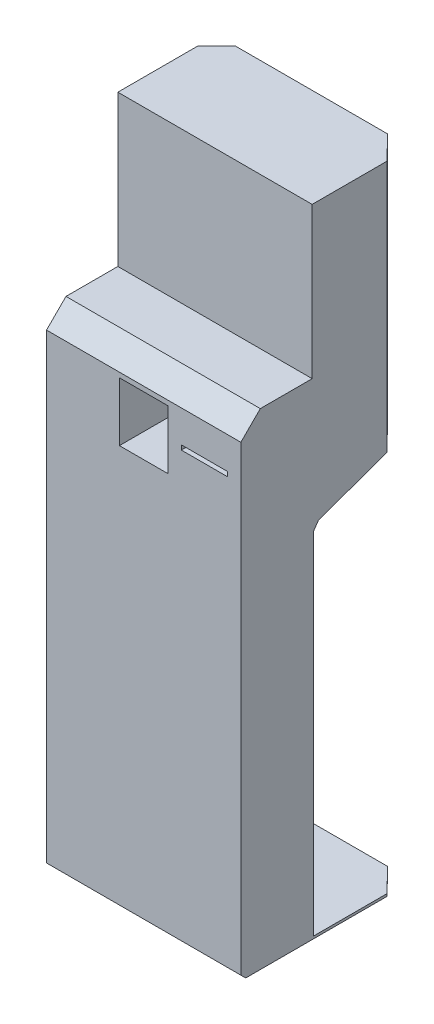
ISO-10303-21;
HEADER;
FILE_DESCRIPTION(('STEP AP214'),'2;1');
FILE_NAME('part.step','',(''),(''),'','','');
FILE_SCHEMA(('AUTOMOTIVE_DESIGN { 1 0 10303 214 1 1 1 1 }'));
ENDSEC;
DATA;
#1=APPLICATION_CONTEXT('core data for automotive mechanical design processes');
#2=APPLICATION_PROTOCOL_DEFINITION('international standard','automotive_design',2000,#1);
#3=PRODUCT_CONTEXT('',#1,'mechanical');
#4=PRODUCT('Part','Part','',(#3));
#5=PRODUCT_RELATED_PRODUCT_CATEGORY('part','',(#4));
#6=PRODUCT_DEFINITION_FORMATION('','',#4);
#7=PRODUCT_DEFINITION_CONTEXT('part definition',#1,'design');
#8=PRODUCT_DEFINITION('design','',#6,#7);
#9=PRODUCT_DEFINITION_SHAPE('','',#8);
#10=(LENGTH_UNIT() NAMED_UNIT(*) SI_UNIT(.MILLI.,.METRE.));
#11=(NAMED_UNIT(*) PLANE_ANGLE_UNIT() SI_UNIT($,.RADIAN.));
#12=(NAMED_UNIT(*) SI_UNIT($,.STERADIAN.) SOLID_ANGLE_UNIT());
#13=UNCERTAINTY_MEASURE_WITH_UNIT(LENGTH_MEASURE(1.E-05),#10,'distance_accuracy_value','');
#14=(GEOMETRIC_REPRESENTATION_CONTEXT(3) GLOBAL_UNCERTAINTY_ASSIGNED_CONTEXT((#13)) GLOBAL_UNIT_ASSIGNED_CONTEXT((#10,
#11,#12)) REPRESENTATION_CONTEXT('',''));
#15=CARTESIAN_POINT('',(0.,0.,0.));
#16=DIRECTION('',(0.,0.,1.));
#17=DIRECTION('',(1.,0.,0.));
#18=AXIS2_PLACEMENT_3D('',#15,#16,#17);
#19=CARTESIAN_POINT('',(400.,5.,0.));
#20=DIRECTION('',(0.,0.,1.));
#21=DIRECTION('',(0.,-1.,0.));
#22=AXIS2_PLACEMENT_3D('',#19,#20,#21);
#23=PLANE('',#22);
#24=DIRECTION('',(-1.,0.,0.));
#25=VECTOR('',#24,1.);
#26=CARTESIAN_POINT('',(400.,0.,0.));
#27=LINE('',#26,#25);
#28=CARTESIAN_POINT('',(351.734705208214,0.,0.));
#29=VERTEX_POINT('',#28);
#30=CARTESIAN_POINT('',(38.6420778551322,0.,0.));
#31=VERTEX_POINT('',#30);
#32=EDGE_CURVE('E283',#29,#31,#27,.T.);
#33=ORIENTED_EDGE('',*,*,#32,.T.);
#34=DIRECTION('',(0.,1.,0.));
#35=VECTOR('',#34,1.);
#36=CARTESIAN_POINT('',(38.6420778551322,5.00000000000004,0.));
#37=LINE('',#36,#35);
#38=CARTESIAN_POINT('',(38.6420778551322,5.,0.));
#39=VERTEX_POINT('',#38);
#40=EDGE_CURVE('E369',#31,#39,#37,.T.);
#41=ORIENTED_EDGE('',*,*,#40,.T.);
#42=DIRECTION('',(-1.,0.,0.));
#43=VECTOR('',#42,1.);
#44=CARTESIAN_POINT('',(400.,5.,0.));
#45=LINE('',#44,#43);
#46=CARTESIAN_POINT('',(351.734705208214,5.,0.));
#47=VERTEX_POINT('',#46);
#48=EDGE_CURVE('E250',#47,#39,#45,.T.);
#49=ORIENTED_EDGE('',*,*,#48,.F.);
#50=DIRECTION('',(0.,-1.,0.));
#51=VECTOR('',#50,1.);
#52=CARTESIAN_POINT('',(351.734705208214,4.99999999999999,0.));
#53=LINE('',#52,#51);
#54=EDGE_CURVE('E370',#47,#29,#53,.T.);
#55=ORIENTED_EDGE('',*,*,#54,.T.);
#56=EDGE_LOOP('',(#33,#41,#49,#55));
#57=FACE_BOUND('',#56,.T.);
#58=ADVANCED_FACE('F35',(#57),#23,.F.);
#59=CARTESIAN_POINT('',(400.,5.,200.));
#60=DIRECTION('',(0.,-1.,0.));
#61=DIRECTION('',(0.,0.,-1.));
#62=AXIS2_PLACEMENT_3D('',#59,#60,#61);
#63=PLANE('',#62);
#64=ORIENTED_EDGE('',*,*,#48,.T.);
#65=DIRECTION('',(-0.701254440401762,0.,0.712911081283502));
#66=VECTOR('',#65,1.);
#67=CARTESIAN_POINT('',(116.356238841946,5.,-79.0059689438939));
#68=LINE('',#67,#66);
#69=CARTESIAN_POINT('',(0.,5.,39.284407940377));
#70=VERTEX_POINT('',#69);
#71=EDGE_CURVE('E378',#39,#70,#68,.T.);
#72=ORIENTED_EDGE('',*,*,#71,.T.);
#73=DIRECTION('',(0.,0.,1.));
#74=VECTOR('',#73,1.);
#75=CARTESIAN_POINT('',(0.,5.,200.));
#76=LINE('',#75,#74);
#77=CARTESIAN_POINT('',(0.,5.,200.));
#78=VERTEX_POINT('',#77);
#79=EDGE_CURVE('E284',#70,#78,#76,.T.);
#80=ORIENTED_EDGE('',*,*,#79,.T.);
#81=DIRECTION('',(-1.,0.,0.));
#82=VECTOR('',#81,1.);
#83=CARTESIAN_POINT('',(400.,5.,200.));
#84=LINE('',#83,#82);
#85=CARTESIAN_POINT('',(400.,5.,200.));
#86=VERTEX_POINT('',#85);
#87=EDGE_CURVE('E247',#86,#78,#84,.T.);
#88=ORIENTED_EDGE('',*,*,#87,.F.);
#89=DIRECTION('',(0.,0.,1.));
#90=VECTOR('',#89,1.);
#91=CARTESIAN_POINT('',(400.,5.,200.));
#92=LINE('',#91,#90);
#93=CARTESIAN_POINT('',(400.,5.,49.0675873350135));
#94=VERTEX_POINT('',#93);
#95=EDGE_CURVE('E310',#94,#86,#92,.T.);
#96=ORIENTED_EDGE('',*,*,#95,.F.);
#97=DIRECTION('',(-0.701254440401762,0.,-0.712911081283502));
#98=VECTOR('',#97,1.);
#99=CARTESIAN_POINT('',(475.455952189898,5.,125.777810280849));
#100=LINE('',#99,#98);
#101=EDGE_CURVE('E57',#94,#47,#100,.T.);
#102=ORIENTED_EDGE('',*,*,#101,.T.);
#103=EDGE_LOOP('',(#64,#72,#80,#88,#96,#102));
#104=FACE_BOUND('',#103,.T.);
#105=ADVANCED_FACE('F358',(#104),#63,.F.);
#106=CARTESIAN_POINT('',(400.,727.20595314676,200.));
#107=DIRECTION('',(0.,0.,1.));
#108=DIRECTION('',(0.,-1.,0.));
#109=AXIS2_PLACEMENT_3D('',#106,#107,#108);
#110=PLANE('',#109);
#111=DIRECTION('',(0.,1.,0.));
#112=VECTOR('',#111,1.);
#113=CARTESIAN_POINT('',(0.,727.20595314676,200.));
#114=LINE('',#113,#112);
#115=CARTESIAN_POINT('',(0.,727.20595314676,200.));
#116=VERTEX_POINT('',#115);
#117=EDGE_CURVE('E286',#78,#116,#114,.T.);
#118=ORIENTED_EDGE('',*,*,#117,.T.);
#119=DIRECTION('',(-1.,0.,0.));
#120=VECTOR('',#119,1.);
#121=CARTESIAN_POINT('',(400.,727.20595314676,200.));
#122=LINE('',#121,#120);
#123=CARTESIAN_POINT('',(400.,727.20595314676,200.));
#124=VERTEX_POINT('',#123);
#125=EDGE_CURVE('E244',#124,#116,#122,.T.);
#126=ORIENTED_EDGE('',*,*,#125,.F.);
#127=DIRECTION('',(0.,1.,0.));
#128=VECTOR('',#127,1.);
#129=CARTESIAN_POINT('',(400.,727.20595314676,200.));
#130=LINE('',#129,#128);
#131=EDGE_CURVE('E458',#86,#124,#130,.T.);
#132=ORIENTED_EDGE('',*,*,#131,.F.);
#133=ORIENTED_EDGE('',*,*,#87,.T.);
#134=EDGE_LOOP('',(#118,#126,#132,#133));
#135=FACE_BOUND('',#134,.T.);
#136=ADVANCED_FACE('F363',(#135),#110,.F.);
#137=CARTESIAN_POINT('',(400.,740.626154580017,190.603073792141));
#138=DIRECTION('',(0.,0.573576436351043,0.819152044288994));
#139=DIRECTION('',(0.,-0.819152044288994,0.573576436351043));
#140=AXIS2_PLACEMENT_3D('',#137,#138,#139);
#141=PLANE('',#140);
#142=DIRECTION('',(0.,0.819152044288994,-0.573576436351043));
#143=VECTOR('',#142,1.);
#144=CARTESIAN_POINT('',(0.,740.626154580017,190.603073792141));
#145=LINE('',#144,#143);
#146=CARTESIAN_POINT('',(0.,740.626154580017,190.603073792141));
#147=VERTEX_POINT('',#146);
#148=EDGE_CURVE('E289',#116,#147,#145,.T.);
#149=ORIENTED_EDGE('',*,*,#148,.T.);
#150=DIRECTION('',(-1.,0.,0.));
#151=VECTOR('',#150,1.);
#152=CARTESIAN_POINT('',(400.,740.626154580017,190.603073792141));
#153=LINE('',#152,#151);
#154=CARTESIAN_POINT('',(400.,740.626154580017,190.603073792141));
#155=VERTEX_POINT('',#154);
#156=EDGE_CURVE('E241',#155,#147,#153,.T.);
#157=ORIENTED_EDGE('',*,*,#156,.F.);
#158=DIRECTION('',(0.,0.819152044288994,-0.573576436351043));
#159=VECTOR('',#158,1.);
#160=CARTESIAN_POINT('',(400.,740.626154580017,190.603073792141));
#161=LINE('',#160,#159);
#162=EDGE_CURVE('E270',#124,#155,#161,.T.);
#163=ORIENTED_EDGE('',*,*,#162,.F.);
#164=ORIENTED_EDGE('',*,*,#125,.T.);
#165=EDGE_LOOP('',(#149,#157,#163,#164));
#166=FACE_BOUND('',#165,.T.);
#167=ADVANCED_FACE('F464',(#166),#141,.F.);
#168=CARTESIAN_POINT('',(400.,806.579798566743,9.39692620785923));
#169=DIRECTION('',(0.,0.939692620785909,0.342020143325666));
#170=DIRECTION('',(0.,-0.342020143325666,0.93969262078591));
#171=AXIS2_PLACEMENT_3D('',#168,#169,#170);
#172=PLANE('',#171);
#173=DIRECTION('',(0.,0.342020143325666,-0.939692620785909));
#174=VECTOR('',#173,1.);
#175=CARTESIAN_POINT('',(0.,806.579798566743,9.39692620785923));
#176=LINE('',#175,#174);
#177=CARTESIAN_POINT('',(0.,795.701644838932,39.284407940377));
#178=VERTEX_POINT('',#177);
#179=EDGE_CURVE('E292',#147,#178,#176,.T.);
#180=ORIENTED_EDGE('',*,*,#179,.T.);
#181=DIRECTION('',(0.678775971324877,0.251160922277189,-0.69005896260598));
#182=VECTOR('',#181,1.);
#183=CARTESIAN_POINT('',(200.148417326644,869.760632209921,-164.190987569091));
#184=LINE('',#183,#182);
#185=CARTESIAN_POINT('',(29.3987985705331,806.579798566743,9.39692620785923));
#186=VERTEX_POINT('',#185);
#187=EDGE_CURVE('E215',#178,#186,#184,.T.);
#188=ORIENTED_EDGE('',*,*,#187,.T.);
#189=DIRECTION('',(-1.,0.,0.));
#190=VECTOR('',#189,1.);
#191=CARTESIAN_POINT('',(400.,806.579798566743,9.39692620785923));
#192=LINE('',#191,#190);
#193=CARTESIAN_POINT('',(360.977984492813,806.579798566743,9.39692620785923));
#194=VERTEX_POINT('',#193);
#195=EDGE_CURVE('E232',#194,#186,#192,.T.);
#196=ORIENTED_EDGE('',*,*,#195,.F.);
#197=DIRECTION('',(0.678775971324877,-0.251160922277189,0.69005896260598));
#198=VECTOR('',#197,1.);
#199=CARTESIAN_POINT('',(378.956863798241,799.927247358945,27.6746604330507));
#200=LINE('',#199,#198);
#201=CARTESIAN_POINT('',(400.,792.140858742798,49.0675873350135));
#202=VERTEX_POINT('',#201);
#203=EDGE_CURVE('E384',#194,#202,#200,.T.);
#204=ORIENTED_EDGE('',*,*,#203,.T.);
#205=DIRECTION('',(0.,0.342020143325666,-0.939692620785909));
#206=VECTOR('',#205,1.);
#207=CARTESIAN_POINT('',(400.,800.,27.4747741945468));
#208=LINE('',#207,#206);
#209=EDGE_CURVE('E263',#155,#202,#208,.T.);
#210=ORIENTED_EDGE('',*,*,#209,.F.);
#211=ORIENTED_EDGE('',*,*,#156,.T.);
#212=EDGE_LOOP('',(#180,#188,#196,#204,#210,#211));
#213=FACE_BOUND('',#212,.T.);
#214=ADVANCED_FACE('F467',(#213),#172,.F.);
#215=CARTESIAN_POINT('',(400.,820.,0.));
#216=DIRECTION('',(0.,0.57357643635105,0.819152044288989));
#217=DIRECTION('',(0.,-0.819152044288989,0.57357643635105));
#218=AXIS2_PLACEMENT_3D('',#215,#216,#217);
#219=PLANE('',#218);
#220=ORIENTED_EDGE('',*,*,#195,.T.);
#221=DIRECTION('',(0.491384255613947,0.713434646777101,-0.499552317693313));
#222=VECTOR('',#221,1.);
#223=CARTESIAN_POINT('',(125.895014880739,946.68144653791,-88.7033038171555));
#224=LINE('',#223,#222);
#225=CARTESIAN_POINT('',(38.6420778551321,820.,1.2490009027033E-13));
#226=VERTEX_POINT('',#225);
#227=EDGE_CURVE('E226',#186,#226,#224,.T.);
#228=ORIENTED_EDGE('',*,*,#227,.T.);
#229=DIRECTION('',(-1.,0.,0.));
#230=VECTOR('',#229,1.);
#231=CARTESIAN_POINT('',(400.,820.,0.));
#232=LINE('',#231,#230);
#233=CARTESIAN_POINT('',(351.734705208214,820.,0.));
#234=VERTEX_POINT('',#233);
#235=EDGE_CURVE('E224',#234,#226,#232,.T.);
#236=ORIENTED_EDGE('',*,*,#235,.F.);
#237=DIRECTION('',(0.491384255613947,-0.713434646777101,0.499552317693313));
#238=VECTOR('',#237,1.);
#239=CARTESIAN_POINT('',(363.388770247092,803.079608922062,11.8477853822285));
#240=LINE('',#239,#238);
#241=EDGE_CURVE('E386',#234,#194,#240,.T.);
#242=ORIENTED_EDGE('',*,*,#241,.T.);
#243=EDGE_LOOP('',(#220,#228,#236,#242));
#244=FACE_BOUND('',#243,.T.);
#245=ADVANCED_FACE('F472',(#244),#219,.F.);
#246=CARTESIAN_POINT('',(400.,1000.,0.));
#247=DIRECTION('',(0.,0.,1.));
#248=DIRECTION('',(0.,-1.,0.));
#249=AXIS2_PLACEMENT_3D('',#246,#247,#248);
#250=PLANE('',#249);
#251=ORIENTED_EDGE('',*,*,#235,.T.);
#252=DIRECTION('',(0.,1.,0.));
#253=VECTOR('',#252,1.);
#254=CARTESIAN_POINT('',(38.6420778551322,1000.,0.));
#255=LINE('',#254,#253);
#256=CARTESIAN_POINT('',(38.6420778551323,1310.69690242,0.));
#257=VERTEX_POINT('',#256);
#258=EDGE_CURVE('E208',#226,#257,#255,.T.);
#259=ORIENTED_EDGE('',*,*,#258,.T.);
#260=DIRECTION('',(-1.,0.,0.));
#261=VECTOR('',#260,1.);
#262=CARTESIAN_POINT('',(400.,1310.69690242,0.));
#263=LINE('',#262,#261);
#264=CARTESIAN_POINT('',(351.734705208214,1310.69690242,0.));
#265=VERTEX_POINT('',#264);
#266=EDGE_CURVE('E222',#265,#257,#263,.T.);
#267=ORIENTED_EDGE('',*,*,#266,.F.);
#268=DIRECTION('',(0.,-1.,0.));
#269=VECTOR('',#268,1.);
#270=CARTESIAN_POINT('',(351.734705208214,1000.,0.));
#271=LINE('',#270,#269);
#272=EDGE_CURVE('E389',#265,#234,#271,.T.);
#273=ORIENTED_EDGE('',*,*,#272,.T.);
#274=EDGE_LOOP('',(#251,#259,#267,#273));
#275=FACE_BOUND('',#274,.T.);
#276=ADVANCED_FACE('F220',(#275),#250,.F.);
#277=CARTESIAN_POINT('',(400.,1310.69690242,203.251091607901));
#278=DIRECTION('',(0.,-1.,0.));
#279=DIRECTION('',(0.,0.,-1.));
#280=AXIS2_PLACEMENT_3D('',#277,#278,#279);
#281=PLANE('',#280);
#282=ORIENTED_EDGE('',*,*,#266,.T.);
#283=DIRECTION('',(-0.701254440401762,0.,0.712911081283502));
#284=VECTOR('',#283,1.);
#285=CARTESIAN_POINT('',(-32.9719100035619,1310.69690242,72.804395349162));
#286=LINE('',#285,#284);
#287=CARTESIAN_POINT('',(0.,1310.69690242,39.284407940377));
#288=VERTEX_POINT('',#287);
#289=EDGE_CURVE('E205',#257,#288,#286,.T.);
#290=ORIENTED_EDGE('',*,*,#289,.T.);
#291=DIRECTION('',(0.,0.,1.));
#292=VECTOR('',#291,1.);
#293=CARTESIAN_POINT('',(0.,1310.69690242,203.251091607901));
#294=LINE('',#293,#292);
#295=CARTESIAN_POINT('',(0.,1310.69690242,203.251091607901));
#296=VERTEX_POINT('',#295);
#297=EDGE_CURVE('E295',#288,#296,#294,.T.);
#298=ORIENTED_EDGE('',*,*,#297,.T.);
#299=DIRECTION('',(-1.,0.,0.));
#300=VECTOR('',#299,1.);
#301=CARTESIAN_POINT('',(400.,1310.69690242,203.251091607901));
#302=LINE('',#301,#300);
#303=CARTESIAN_POINT('',(400.,1310.69690242,203.251091607901));
#304=VERTEX_POINT('',#303);
#305=EDGE_CURVE('E230',#304,#296,#302,.T.);
#306=ORIENTED_EDGE('',*,*,#305,.F.);
#307=DIRECTION('',(0.,0.,1.));
#308=VECTOR('',#307,1.);
#309=CARTESIAN_POINT('',(400.,1310.69690242,0.));
#310=LINE('',#309,#308);
#311=CARTESIAN_POINT('',(400.,1310.69690242,49.0675873350135));
#312=VERTEX_POINT('',#311);
#313=EDGE_CURVE('E260',#312,#304,#310,.T.);
#314=ORIENTED_EDGE('',*,*,#313,.F.);
#315=DIRECTION('',(-0.701254440401762,0.,-0.712911081283502));
#316=VECTOR('',#315,1.);
#317=CARTESIAN_POINT('',(322.648629758769,1310.69690242,-29.5695603539813));
#318=LINE('',#317,#316);
#319=EDGE_CURVE('E49',#312,#265,#318,.T.);
#320=ORIENTED_EDGE('',*,*,#319,.T.);
#321=EDGE_LOOP('',(#282,#290,#298,#306,#314,#320));
#322=FACE_BOUND('',#321,.T.);
#323=ADVANCED_FACE('F228',(#322),#281,.F.);
#324=CARTESIAN_POINT('',(400.,1000.,203.251091607901));
#325=DIRECTION('',(0.,0.,-1.));
#326=DIRECTION('',(-1.,0.,0.));
#327=AXIS2_PLACEMENT_3D('',#324,#325,#326);
#328=PLANE('',#327);
#329=DIRECTION('',(0.,-1.,0.));
#330=VECTOR('',#329,1.);
#331=CARTESIAN_POINT('',(0.,1000.,203.251091607901));
#332=LINE('',#331,#330);
#333=CARTESIAN_POINT('',(0.,1000.,203.251091607901));
#334=VERTEX_POINT('',#333);
#335=EDGE_CURVE('E297',#296,#334,#332,.T.);
#336=ORIENTED_EDGE('',*,*,#335,.T.);
#337=DIRECTION('',(-1.,0.,0.));
#338=VECTOR('',#337,1.);
#339=CARTESIAN_POINT('',(400.,1000.,203.251091607901));
#340=LINE('',#339,#338);
#341=CARTESIAN_POINT('',(400.,1000.,203.251091607901));
#342=VERTEX_POINT('',#341);
#343=EDGE_CURVE('E235',#342,#334,#340,.T.);
#344=ORIENTED_EDGE('',*,*,#343,.F.);
#345=DIRECTION('',(0.,-1.,0.));
#346=VECTOR('',#345,1.);
#347=CARTESIAN_POINT('',(400.,1000.,203.251091607901));
#348=LINE('',#347,#346);
#349=EDGE_CURVE('E266',#304,#342,#348,.T.);
#350=ORIENTED_EDGE('',*,*,#349,.F.);
#351=ORIENTED_EDGE('',*,*,#305,.T.);
#352=EDGE_LOOP('',(#336,#344,#350,#351));
#353=FACE_BOUND('',#352,.T.);
#354=ADVANCED_FACE('F348',(#353),#328,.F.);
#355=CARTESIAN_POINT('',(400.,1000.,310.));
#356=DIRECTION('',(0.,-1.,0.));
#357=DIRECTION('',(0.,0.,-1.));
#358=AXIS2_PLACEMENT_3D('',#355,#356,#357);
#359=PLANE('',#358);
#360=DIRECTION('',(0.,0.,1.));
#361=VECTOR('',#360,1.);
#362=CARTESIAN_POINT('',(0.,1000.,310.));
#363=LINE('',#362,#361);
#364=CARTESIAN_POINT('',(0.,1000.,310.));
#365=VERTEX_POINT('',#364);
#366=EDGE_CURVE('E299',#334,#365,#363,.T.);
#367=ORIENTED_EDGE('',*,*,#366,.T.);
#368=DIRECTION('',(-1.,0.,0.));
#369=VECTOR('',#368,1.);
#370=CARTESIAN_POINT('',(400.,1000.,310.));
#371=LINE('',#370,#369);
#372=CARTESIAN_POINT('',(400.,1000.,310.));
#373=VERTEX_POINT('',#372);
#374=EDGE_CURVE('E322',#373,#365,#371,.T.);
#375=ORIENTED_EDGE('',*,*,#374,.F.);
#376=DIRECTION('',(0.,0.,1.));
#377=VECTOR('',#376,1.);
#378=CARTESIAN_POINT('',(400.,1000.,310.));
#379=LINE('',#378,#377);
#380=EDGE_CURVE('E268',#342,#373,#379,.T.);
#381=ORIENTED_EDGE('',*,*,#380,.F.);
#382=ORIENTED_EDGE('',*,*,#343,.T.);
#383=EDGE_LOOP('',(#367,#375,#381,#382));
#384=FACE_BOUND('',#383,.T.);
#385=ADVANCED_FACE('F329',(#384),#359,.F.);
#386=CARTESIAN_POINT('',(400.,1000.,310.));
#387=DIRECTION('',(0.,-0.707106781186547,-0.707106781186547));
#388=DIRECTION('',(0.,0.707106781186548,-0.707106781186548));
#389=AXIS2_PLACEMENT_3D('',#386,#387,#388);
#390=PLANE('',#389);
#391=DIRECTION('',(0.,-0.707106781186547,0.707106781186547));
#392=VECTOR('',#391,1.);
#393=CARTESIAN_POINT('',(0.,1000.,310.));
#394=LINE('',#393,#392);
#395=CARTESIAN_POINT('',(0.,960.,350.));
#396=VERTEX_POINT('',#395);
#397=EDGE_CURVE('E301',#365,#396,#394,.T.);
#398=ORIENTED_EDGE('',*,*,#397,.T.);
#399=DIRECTION('',(-1.,0.,0.));
#400=VECTOR('',#399,1.);
#401=CARTESIAN_POINT('',(400.,960.,350.));
#402=LINE('',#401,#400);
#403=CARTESIAN_POINT('',(400.,960.,350.));
#404=VERTEX_POINT('',#403);
#405=EDGE_CURVE('E319',#404,#396,#402,.T.);
#406=ORIENTED_EDGE('',*,*,#405,.F.);
#407=DIRECTION('',(0.,-0.707106781186547,0.707106781186547));
#408=VECTOR('',#407,1.);
#409=CARTESIAN_POINT('',(400.,1000.,310.));
#410=LINE('',#409,#408);
#411=EDGE_CURVE('E275',#373,#404,#410,.T.);
#412=ORIENTED_EDGE('',*,*,#411,.F.);
#413=ORIENTED_EDGE('',*,*,#374,.T.);
#414=EDGE_LOOP('',(#398,#406,#412,#413));
#415=FACE_BOUND('',#414,.T.);
#416=ADVANCED_FACE('F340',(#415),#390,.F.);
#417=CARTESIAN_POINT('',(400.,9.99999999999996,350.));
#418=DIRECTION('',(0.,0.,-1.));
#419=DIRECTION('',(0.,1.,0.));
#420=AXIS2_PLACEMENT_3D('',#417,#418,#419);
#421=PLANE('',#420);
#422=DIRECTION('',(-1.,0.,0.));
#423=VECTOR('',#422,1.);
#424=CARTESIAN_POINT('',(372.65,894.2,350.));
#425=LINE('',#424,#423);
#426=CARTESIAN_POINT('',(372.65,894.2,350.));
#427=VERTEX_POINT('',#426);
#428=CARTESIAN_POINT('',(277.35,894.2,350.));
#429=VERTEX_POINT('',#428);
#430=EDGE_CURVE('E410',#427,#429,#425,.T.);
#431=ORIENTED_EDGE('',*,*,#430,.F.);
#432=DIRECTION('',(0.,1.,0.));
#433=VECTOR('',#432,1.);
#434=CARTESIAN_POINT('',(372.65,894.2,350.));
#435=LINE('',#434,#433);
#436=CARTESIAN_POINT('',(372.65,884.8,350.));
#437=VERTEX_POINT('',#436);
#438=EDGE_CURVE('E394',#437,#427,#435,.T.);
#439=ORIENTED_EDGE('',*,*,#438,.F.);
#440=DIRECTION('',(1.,0.,0.));
#441=VECTOR('',#440,1.);
#442=CARTESIAN_POINT('',(372.65,884.8,350.));
#443=LINE('',#442,#441);
#444=CARTESIAN_POINT('',(277.35,884.8,350.));
#445=VERTEX_POINT('',#444);
#446=EDGE_CURVE('E399',#445,#437,#443,.T.);
#447=ORIENTED_EDGE('',*,*,#446,.F.);
#448=DIRECTION('',(0.,-1.,0.));
#449=VECTOR('',#448,1.);
#450=CARTESIAN_POINT('',(277.35,894.2,350.));
#451=LINE('',#450,#449);
#452=EDGE_CURVE('E413',#429,#445,#451,.T.);
#453=ORIENTED_EDGE('',*,*,#452,.F.);
#454=EDGE_LOOP('',(#431,#439,#447,#453));
#455=FACE_BOUND('',#454,.T.);
#456=DIRECTION('',(1.,0.,0.));
#457=VECTOR('',#456,1.);
#458=CARTESIAN_POINT('',(150.,829.,350.));
#459=LINE('',#458,#457);
#460=CARTESIAN_POINT('',(150.,829.,350.));
#461=VERTEX_POINT('',#460);
#462=CARTESIAN_POINT('',(250.,829.,350.));
#463=VERTEX_POINT('',#462);
#464=EDGE_CURVE('E442',#461,#463,#459,.T.);
#465=ORIENTED_EDGE('',*,*,#464,.F.);
#466=DIRECTION('',(0.,-1.,0.));
#467=VECTOR('',#466,1.);
#468=CARTESIAN_POINT('',(150.,950.,350.));
#469=LINE('',#468,#467);
#470=CARTESIAN_POINT('',(150.,950.,350.));
#471=VERTEX_POINT('',#470);
#472=EDGE_CURVE('E420',#471,#461,#469,.T.);
#473=ORIENTED_EDGE('',*,*,#472,.F.);
#474=DIRECTION('',(-1.,0.,0.));
#475=VECTOR('',#474,1.);
#476=CARTESIAN_POINT('',(150.,950.,350.));
#477=LINE('',#476,#475);
#478=CARTESIAN_POINT('',(250.,950.,350.));
#479=VERTEX_POINT('',#478);
#480=EDGE_CURVE('E431',#479,#471,#477,.T.);
#481=ORIENTED_EDGE('',*,*,#480,.F.);
#482=DIRECTION('',(0.,1.,0.));
#483=VECTOR('',#482,1.);
#484=CARTESIAN_POINT('',(250.,950.,350.));
#485=LINE('',#484,#483);
#486=EDGE_CURVE('E445',#463,#479,#485,.T.);
#487=ORIENTED_EDGE('',*,*,#486,.F.);
#488=EDGE_LOOP('',(#465,#473,#481,#487));
#489=FACE_BOUND('',#488,.T.);
#490=DIRECTION('',(0.,-1.,0.));
#491=VECTOR('',#490,1.);
#492=CARTESIAN_POINT('',(0.,9.99999999999996,350.));
#493=LINE('',#492,#491);
#494=CARTESIAN_POINT('',(0.,9.99999999999996,350.));
#495=VERTEX_POINT('',#494);
#496=EDGE_CURVE('E303',#396,#495,#493,.T.);
#497=ORIENTED_EDGE('',*,*,#496,.T.);
#498=DIRECTION('',(-1.,0.,0.));
#499=VECTOR('',#498,1.);
#500=CARTESIAN_POINT('',(400.,9.99999999999996,350.));
#501=LINE('',#500,#499);
#502=CARTESIAN_POINT('',(400.,9.99999999999996,350.));
#503=VERTEX_POINT('',#502);
#504=EDGE_CURVE('E316',#503,#495,#501,.T.);
#505=ORIENTED_EDGE('',*,*,#504,.F.);
#506=DIRECTION('',(0.,-1.,0.));
#507=VECTOR('',#506,1.);
#508=CARTESIAN_POINT('',(400.,9.99999999999996,350.));
#509=LINE('',#508,#507);
#510=EDGE_CURVE('E277',#404,#503,#509,.T.);
#511=ORIENTED_EDGE('',*,*,#510,.F.);
#512=ORIENTED_EDGE('',*,*,#405,.T.);
#513=EDGE_LOOP('',(#497,#505,#511,#512));
#514=FACE_BOUND('',#513,.T.);
#515=ADVANCED_FACE('F344',(#455,#489,#514),#421,.F.);
#516=CARTESIAN_POINT('',(400.,0.,340.));
#517=DIRECTION('',(0.,0.707106781186548,-0.707106781186547));
#518=DIRECTION('',(0.,0.707106781186547,0.707106781186548));
#519=AXIS2_PLACEMENT_3D('',#516,#517,#518);
#520=PLANE('',#519);
#521=DIRECTION('',(0.,-0.707106781186547,-0.707106781186548));
#522=VECTOR('',#521,1.);
#523=CARTESIAN_POINT('',(0.,0.,340.));
#524=LINE('',#523,#522);
#525=CARTESIAN_POINT('',(0.,0.,340.));
#526=VERTEX_POINT('',#525);
#527=EDGE_CURVE('E305',#495,#526,#524,.T.);
#528=ORIENTED_EDGE('',*,*,#527,.T.);
#529=DIRECTION('',(-1.,0.,0.));
#530=VECTOR('',#529,1.);
#531=CARTESIAN_POINT('',(400.,0.,340.));
#532=LINE('',#531,#530);
#533=CARTESIAN_POINT('',(400.,0.,340.));
#534=VERTEX_POINT('',#533);
#535=EDGE_CURVE('E313',#534,#526,#532,.T.);
#536=ORIENTED_EDGE('',*,*,#535,.F.);
#537=DIRECTION('',(0.,-0.707106781186547,-0.707106781186548));
#538=VECTOR('',#537,1.);
#539=CARTESIAN_POINT('',(400.,0.,340.));
#540=LINE('',#539,#538);
#541=EDGE_CURVE('E279',#503,#534,#540,.T.);
#542=ORIENTED_EDGE('',*,*,#541,.F.);
#543=ORIENTED_EDGE('',*,*,#504,.T.);
#544=EDGE_LOOP('',(#528,#536,#542,#543));
#545=FACE_BOUND('',#544,.T.);
#546=ADVANCED_FACE('F537',(#545),#520,.F.);
#547=CARTESIAN_POINT('',(400.,0.,0.));
#548=DIRECTION('',(0.,1.,0.));
#549=DIRECTION('',(0.,0.,1.));
#550=AXIS2_PLACEMENT_3D('',#547,#548,#549);
#551=PLANE('',#550);
#552=DIRECTION('',(0.,0.,-1.));
#553=VECTOR('',#552,1.);
#554=CARTESIAN_POINT('',(0.,0.,0.));
#555=LINE('',#554,#553);
#556=CARTESIAN_POINT('',(0.,0.,39.284407940377));
#557=VERTEX_POINT('',#556);
#558=EDGE_CURVE('E307',#526,#557,#555,.T.);
#559=ORIENTED_EDGE('',*,*,#558,.T.);
#560=DIRECTION('',(0.701254440401762,0.,-0.712911081283502));
#561=VECTOR('',#560,1.);
#562=CARTESIAN_POINT('',(216.342651114281,0.,-180.654410907256));
#563=LINE('',#562,#561);
#564=EDGE_CURVE('E225',#557,#31,#563,.T.);
#565=ORIENTED_EDGE('',*,*,#564,.T.);
#566=ORIENTED_EDGE('',*,*,#32,.F.);
#567=DIRECTION('',(0.701254440401762,0.,0.712911081283502));
#568=VECTOR('',#567,1.);
#569=CARTESIAN_POINT('',(375.469539917563,0.,24.1293683174868));
#570=LINE('',#569,#568);
#571=CARTESIAN_POINT('',(400.,0.,49.0675873350135));
#572=VERTEX_POINT('',#571);
#573=EDGE_CURVE('E376',#29,#572,#570,.T.);
#574=ORIENTED_EDGE('',*,*,#573,.T.);
#575=DIRECTION('',(0.,0.,-1.));
#576=VECTOR('',#575,1.);
#577=CARTESIAN_POINT('',(400.,0.,0.));
#578=LINE('',#577,#576);
#579=EDGE_CURVE('E281',#534,#572,#578,.T.);
#580=ORIENTED_EDGE('',*,*,#579,.F.);
#581=ORIENTED_EDGE('',*,*,#535,.T.);
#582=EDGE_LOOP('',(#559,#565,#566,#574,#580,#581));
#583=FACE_BOUND('',#582,.T.);
#584=ADVANCED_FACE('F374',(#583),#551,.F.);
#585=CARTESIAN_POINT('',(400.,0.,0.));
#586=DIRECTION('',(-1.,0.,0.));
#587=DIRECTION('',(0.,0.,1.));
#588=AXIS2_PLACEMENT_3D('',#585,#586,#587);
#589=PLANE('',#588);
#590=ORIENTED_EDGE('',*,*,#579,.T.);
#591=DIRECTION('',(0.,1.,0.));
#592=VECTOR('',#591,1.);
#593=CARTESIAN_POINT('',(400.,0.,49.0675873350135));
#594=LINE('',#593,#592);
#595=EDGE_CURVE('E11',#572,#94,#594,.T.);
#596=ORIENTED_EDGE('',*,*,#595,.T.);
#597=ORIENTED_EDGE('',*,*,#95,.T.);
#598=ORIENTED_EDGE('',*,*,#131,.T.);
#599=ORIENTED_EDGE('',*,*,#162,.T.);
#600=ORIENTED_EDGE('',*,*,#209,.T.);
#601=EDGE_CURVE('E38',#202,#312,#594,.T.);
#602=ORIENTED_EDGE('',*,*,#601,.T.);
#603=ORIENTED_EDGE('',*,*,#313,.T.);
#604=ORIENTED_EDGE('',*,*,#349,.T.);
#605=ORIENTED_EDGE('',*,*,#380,.T.);
#606=ORIENTED_EDGE('',*,*,#411,.T.);
#607=ORIENTED_EDGE('',*,*,#510,.T.);
#608=ORIENTED_EDGE('',*,*,#541,.T.);
#609=EDGE_LOOP('',(#590,#596,#597,#598,#599,#600,#602,#603,#604,#605,#606,#607,#608));
#610=FACE_BOUND('',#609,.T.);
#611=ADVANCED_FACE('F259',(#610),#589,.F.);
#612=CARTESIAN_POINT('',(0.,0.,0.));
#613=DIRECTION('',(-1.,0.,0.));
#614=DIRECTION('',(0.,0.,1.));
#615=AXIS2_PLACEMENT_3D('',#612,#613,#614);
#616=PLANE('',#615);
#617=DIRECTION('',(0.,1.,0.));
#618=VECTOR('',#617,1.);
#619=CARTESIAN_POINT('',(0.,0.,39.284407940377));
#620=LINE('',#619,#618);
#621=EDGE_CURVE('E252',#557,#70,#620,.T.);
#622=ORIENTED_EDGE('',*,*,#621,.F.);
#623=ORIENTED_EDGE('',*,*,#558,.F.);
#624=ORIENTED_EDGE('',*,*,#527,.F.);
#625=ORIENTED_EDGE('',*,*,#496,.F.);
#626=ORIENTED_EDGE('',*,*,#397,.F.);
#627=ORIENTED_EDGE('',*,*,#366,.F.);
#628=ORIENTED_EDGE('',*,*,#335,.F.);
#629=ORIENTED_EDGE('',*,*,#297,.F.);
#630=EDGE_CURVE('E211',#178,#288,#620,.T.);
#631=ORIENTED_EDGE('',*,*,#630,.F.);
#632=ORIENTED_EDGE('',*,*,#179,.F.);
#633=ORIENTED_EDGE('',*,*,#148,.F.);
#634=ORIENTED_EDGE('',*,*,#117,.F.);
#635=ORIENTED_EDGE('',*,*,#79,.F.);
#636=EDGE_LOOP('',(#622,#623,#624,#625,#626,#627,#628,#629,#631,#632,#633,#634,#635));
#637=FACE_BOUND('',#636,.T.);
#638=ADVANCED_FACE('F335',(#637),#616,.T.);
#639=CARTESIAN_POINT('',(150.,950.,81.9999999999999));
#640=DIRECTION('',(-1.,0.,0.));
#641=DIRECTION('',(0.,-1.,0.));
#642=AXIS2_PLACEMENT_3D('',#639,#640,#641);
#643=PLANE('',#642);
#644=ORIENTED_EDGE('',*,*,#472,.T.);
#645=DIRECTION('',(0.,0.,1.));
#646=VECTOR('',#645,1.);
#647=CARTESIAN_POINT('',(150.,829.,81.9999999999999));
#648=LINE('',#647,#646);
#649=CARTESIAN_POINT('',(150.,829.,81.9999999999999));
#650=VERTEX_POINT('',#649);
#651=EDGE_CURVE('E440',#650,#461,#648,.T.);
#652=ORIENTED_EDGE('',*,*,#651,.F.);
#653=DIRECTION('',(0.,-1.,0.));
#654=VECTOR('',#653,1.);
#655=CARTESIAN_POINT('',(150.,950.,81.9999999999999));
#656=LINE('',#655,#654);
#657=CARTESIAN_POINT('',(150.,950.,81.9999999999999));
#658=VERTEX_POINT('',#657);
#659=EDGE_CURVE('E427',#658,#650,#656,.T.);
#660=ORIENTED_EDGE('',*,*,#659,.F.);
#661=DIRECTION('',(0.,0.,1.));
#662=VECTOR('',#661,1.);
#663=CARTESIAN_POINT('',(150.,950.,81.9999999999999));
#664=LINE('',#663,#662);
#665=EDGE_CURVE('E287',#658,#471,#664,.T.);
#666=ORIENTED_EDGE('',*,*,#665,.T.);
#667=EDGE_LOOP('',(#644,#652,#660,#666));
#668=FACE_BOUND('',#667,.T.);
#669=ADVANCED_FACE('F520',(#668),#643,.F.);
#670=CARTESIAN_POINT('',(150.,950.,81.9999999999999));
#671=DIRECTION('',(0.,1.,0.));
#672=DIRECTION('',(0.,0.,1.));
#673=AXIS2_PLACEMENT_3D('',#670,#671,#672);
#674=PLANE('',#673);
#675=ORIENTED_EDGE('',*,*,#480,.T.);
#676=ORIENTED_EDGE('',*,*,#665,.F.);
#677=DIRECTION('',(-1.,0.,0.));
#678=VECTOR('',#677,1.);
#679=CARTESIAN_POINT('',(150.,950.,81.9999999999999));
#680=LINE('',#679,#678);
#681=CARTESIAN_POINT('',(250.,950.,81.9999999999999));
#682=VERTEX_POINT('',#681);
#683=EDGE_CURVE('E437',#682,#658,#680,.T.);
#684=ORIENTED_EDGE('',*,*,#683,.F.);
#685=DIRECTION('',(0.,0.,1.));
#686=VECTOR('',#685,1.);
#687=CARTESIAN_POINT('',(250.,950.,81.9999999999999));
#688=LINE('',#687,#686);
#689=EDGE_CURVE('E451',#682,#479,#688,.T.);
#690=ORIENTED_EDGE('',*,*,#689,.T.);
#691=EDGE_LOOP('',(#675,#676,#684,#690));
#692=FACE_BOUND('',#691,.T.);
#693=ADVANCED_FACE('F516',(#692),#674,.F.);
#694=CARTESIAN_POINT('',(250.,950.,81.9999999999999));
#695=DIRECTION('',(1.,0.,0.));
#696=DIRECTION('',(0.,1.,0.));
#697=AXIS2_PLACEMENT_3D('',#694,#695,#696);
#698=PLANE('',#697);
#699=ORIENTED_EDGE('',*,*,#486,.T.);
#700=ORIENTED_EDGE('',*,*,#689,.F.);
#701=DIRECTION('',(0.,1.,0.));
#702=VECTOR('',#701,1.);
#703=CARTESIAN_POINT('',(250.,950.,81.9999999999999));
#704=LINE('',#703,#702);
#705=CARTESIAN_POINT('',(250.,829.,81.9999999999999));
#706=VERTEX_POINT('',#705);
#707=EDGE_CURVE('E434',#706,#682,#704,.T.);
#708=ORIENTED_EDGE('',*,*,#707,.F.);
#709=DIRECTION('',(0.,0.,1.));
#710=VECTOR('',#709,1.);
#711=CARTESIAN_POINT('',(250.,829.,81.9999999999999));
#712=LINE('',#711,#710);
#713=EDGE_CURVE('E453',#706,#463,#712,.T.);
#714=ORIENTED_EDGE('',*,*,#713,.T.);
#715=EDGE_LOOP('',(#699,#700,#708,#714));
#716=FACE_BOUND('',#715,.T.);
#717=ADVANCED_FACE('F519',(#716),#698,.F.);
#718=CARTESIAN_POINT('',(150.,829.,81.9999999999999));
#719=DIRECTION('',(0.,-1.,0.));
#720=DIRECTION('',(0.,0.,-1.));
#721=AXIS2_PLACEMENT_3D('',#718,#719,#720);
#722=PLANE('',#721);
#723=ORIENTED_EDGE('',*,*,#464,.T.);
#724=ORIENTED_EDGE('',*,*,#713,.F.);
#725=DIRECTION('',(1.,0.,0.));
#726=VECTOR('',#725,1.);
#727=CARTESIAN_POINT('',(150.,829.,81.9999999999999));
#728=LINE('',#727,#726);
#729=EDGE_CURVE('E430',#650,#706,#728,.T.);
#730=ORIENTED_EDGE('',*,*,#729,.F.);
#731=ORIENTED_EDGE('',*,*,#651,.T.);
#732=EDGE_LOOP('',(#723,#724,#730,#731));
#733=FACE_BOUND('',#732,.T.);
#734=ADVANCED_FACE('F514',(#733),#722,.F.);
#735=CARTESIAN_POINT('',(0.,0.,81.9999999999999));
#736=DIRECTION('',(0.,0.,1.));
#737=DIRECTION('',(1.,0.,0.));
#738=AXIS2_PLACEMENT_3D('',#735,#736,#737);
#739=PLANE('',#738);
#740=ORIENTED_EDGE('',*,*,#659,.T.);
#741=ORIENTED_EDGE('',*,*,#729,.T.);
#742=ORIENTED_EDGE('',*,*,#707,.T.);
#743=ORIENTED_EDGE('',*,*,#683,.T.);
#744=EDGE_LOOP('',(#740,#741,#742,#743));
#745=FACE_BOUND('',#744,.T.);
#746=ADVANCED_FACE('F510',(#745),#739,.T.);
#747=CARTESIAN_POINT('',(372.65,894.2,81.9999999999999));
#748=DIRECTION('',(1.,0.,0.));
#749=DIRECTION('',(0.,0.,-1.));
#750=AXIS2_PLACEMENT_3D('',#747,#748,#749);
#751=PLANE('',#750);
#752=ORIENTED_EDGE('',*,*,#438,.T.);
#753=DIRECTION('',(0.,0.,1.));
#754=VECTOR('',#753,1.);
#755=CARTESIAN_POINT('',(372.65,894.2,81.9999999999999));
#756=LINE('',#755,#754);
#757=CARTESIAN_POINT('',(372.65,894.2,81.9999999999999));
#758=VERTEX_POINT('',#757);
#759=EDGE_CURVE('E408',#758,#427,#756,.T.);
#760=ORIENTED_EDGE('',*,*,#759,.F.);
#761=DIRECTION('',(0.,1.,0.));
#762=VECTOR('',#761,1.);
#763=CARTESIAN_POINT('',(372.65,894.2,81.9999999999999));
#764=LINE('',#763,#762);
#765=CARTESIAN_POINT('',(372.65,884.8,81.9999999999999));
#766=VERTEX_POINT('',#765);
#767=EDGE_CURVE('E395',#766,#758,#764,.T.);
#768=ORIENTED_EDGE('',*,*,#767,.F.);
#769=DIRECTION('',(0.,0.,1.));
#770=VECTOR('',#769,1.);
#771=CARTESIAN_POINT('',(372.65,884.8,81.9999999999999));
#772=LINE('',#771,#770);
#773=EDGE_CURVE('E418',#766,#437,#772,.T.);
#774=ORIENTED_EDGE('',*,*,#773,.T.);
#775=EDGE_LOOP('',(#752,#760,#768,#774));
#776=FACE_BOUND('',#775,.T.);
#777=ADVANCED_FACE('F500',(#776),#751,.F.);
#778=CARTESIAN_POINT('',(372.65,884.8,81.9999999999999));
#779=DIRECTION('',(0.,-1.,0.));
#780=DIRECTION('',(0.,0.,-1.));
#781=AXIS2_PLACEMENT_3D('',#778,#779,#780);
#782=PLANE('',#781);
#783=ORIENTED_EDGE('',*,*,#446,.T.);
#784=ORIENTED_EDGE('',*,*,#773,.F.);
#785=DIRECTION('',(1.,0.,0.));
#786=VECTOR('',#785,1.);
#787=CARTESIAN_POINT('',(372.65,884.8,81.9999999999999));
#788=LINE('',#787,#786);
#789=CARTESIAN_POINT('',(277.35,884.8,81.9999999999999));
#790=VERTEX_POINT('',#789);
#791=EDGE_CURVE('E405',#790,#766,#788,.T.);
#792=ORIENTED_EDGE('',*,*,#791,.F.);
#793=DIRECTION('',(0.,0.,1.));
#794=VECTOR('',#793,1.);
#795=CARTESIAN_POINT('',(277.35,884.8,81.9999999999999));
#796=LINE('',#795,#794);
#797=EDGE_CURVE('E421',#790,#445,#796,.T.);
#798=ORIENTED_EDGE('',*,*,#797,.T.);
#799=EDGE_LOOP('',(#783,#784,#792,#798));
#800=FACE_BOUND('',#799,.T.);
#801=ADVANCED_FACE('F496',(#800),#782,.F.);
#802=CARTESIAN_POINT('',(277.35,894.2,81.9999999999999));
#803=DIRECTION('',(-1.,0.,0.));
#804=DIRECTION('',(0.,0.,1.));
#805=AXIS2_PLACEMENT_3D('',#802,#803,#804);
#806=PLANE('',#805);
#807=ORIENTED_EDGE('',*,*,#452,.T.);
#808=ORIENTED_EDGE('',*,*,#797,.F.);
#809=DIRECTION('',(0.,-1.,0.));
#810=VECTOR('',#809,1.);
#811=CARTESIAN_POINT('',(277.35,894.2,81.9999999999999));
#812=LINE('',#811,#810);
#813=CARTESIAN_POINT('',(277.35,894.2,81.9999999999999));
#814=VERTEX_POINT('',#813);
#815=EDGE_CURVE('E402',#814,#790,#812,.T.);
#816=ORIENTED_EDGE('',*,*,#815,.F.);
#817=DIRECTION('',(0.,0.,1.));
#818=VECTOR('',#817,1.);
#819=CARTESIAN_POINT('',(277.35,894.2,81.9999999999999));
#820=LINE('',#819,#818);
#821=EDGE_CURVE('E423',#814,#429,#820,.T.);
#822=ORIENTED_EDGE('',*,*,#821,.T.);
#823=EDGE_LOOP('',(#807,#808,#816,#822));
#824=FACE_BOUND('',#823,.T.);
#825=ADVANCED_FACE('F499',(#824),#806,.F.);
#826=CARTESIAN_POINT('',(372.65,894.2,81.9999999999999));
#827=DIRECTION('',(0.,1.,0.));
#828=DIRECTION('',(-1.,0.,0.));
#829=AXIS2_PLACEMENT_3D('',#826,#827,#828);
#830=PLANE('',#829);
#831=ORIENTED_EDGE('',*,*,#430,.T.);
#832=ORIENTED_EDGE('',*,*,#821,.F.);
#833=DIRECTION('',(-1.,0.,0.));
#834=VECTOR('',#833,1.);
#835=CARTESIAN_POINT('',(372.65,894.2,81.9999999999999));
#836=LINE('',#835,#834);
#837=EDGE_CURVE('E398',#758,#814,#836,.T.);
#838=ORIENTED_EDGE('',*,*,#837,.F.);
#839=ORIENTED_EDGE('',*,*,#759,.T.);
#840=EDGE_LOOP('',(#831,#832,#838,#839));
#841=FACE_BOUND('',#840,.T.);
#842=ADVANCED_FACE('F494',(#841),#830,.F.);
#843=CARTESIAN_POINT('',(0.,0.,81.9999999999999));
#844=DIRECTION('',(0.,0.,-1.));
#845=DIRECTION('',(-1.,0.,0.));
#846=AXIS2_PLACEMENT_3D('',#843,#844,#845);
#847=PLANE('',#846);
#848=ORIENTED_EDGE('',*,*,#767,.T.);
#849=ORIENTED_EDGE('',*,*,#837,.T.);
#850=ORIENTED_EDGE('',*,*,#815,.T.);
#851=ORIENTED_EDGE('',*,*,#791,.T.);
#852=EDGE_LOOP('',(#848,#849,#850,#851));
#853=FACE_BOUND('',#852,.T.);
#854=ADVANCED_FACE('F489',(#853),#847,.F.);
#855=CARTESIAN_POINT('',(-32.9719100035619,1310.69690242,72.804395349162));
#856=DIRECTION('',(0.712911081283502,0.,0.701254440401762));
#857=DIRECTION('',(0.701254440401762,0.,-0.712911081283502));
#858=AXIS2_PLACEMENT_3D('',#855,#856,#857);
#859=PLANE('',#858);
#860=ORIENTED_EDGE('',*,*,#227,.F.);
#861=ORIENTED_EDGE('',*,*,#187,.F.);
#862=ORIENTED_EDGE('',*,*,#630,.T.);
#863=ORIENTED_EDGE('',*,*,#289,.F.);
#864=ORIENTED_EDGE('',*,*,#258,.F.);
#865=EDGE_LOOP('',(#860,#861,#862,#863,#864));
#866=FACE_BOUND('',#865,.T.);
#867=ADVANCED_FACE('F207',(#866),#859,.F.);
#868=ORIENTED_EDGE('',*,*,#564,.F.);
#869=ORIENTED_EDGE('',*,*,#621,.T.);
#870=ORIENTED_EDGE('',*,*,#71,.F.);
#871=ORIENTED_EDGE('',*,*,#40,.F.);
#872=EDGE_LOOP('',(#868,#869,#870,#871));
#873=FACE_BOUND('',#872,.T.);
#874=ADVANCED_FACE('F480',(#873),#859,.F.);
#875=CARTESIAN_POINT('',(322.648629758769,1310.69690242,-29.5695603539813));
#876=DIRECTION('',(-0.712911081283502,0.,0.701254440401762));
#877=DIRECTION('',(0.701254440401762,0.,0.712911081283502));
#878=AXIS2_PLACEMENT_3D('',#875,#876,#877);
#879=PLANE('',#878);
#880=ORIENTED_EDGE('',*,*,#319,.F.);
#881=ORIENTED_EDGE('',*,*,#601,.F.);
#882=ORIENTED_EDGE('',*,*,#203,.F.);
#883=ORIENTED_EDGE('',*,*,#241,.F.);
#884=ORIENTED_EDGE('',*,*,#272,.F.);
#885=EDGE_LOOP('',(#880,#881,#882,#883,#884));
#886=FACE_BOUND('',#885,.T.);
#887=ADVANCED_FACE('F470',(#886),#879,.F.);
#888=ORIENTED_EDGE('',*,*,#101,.F.);
#889=ORIENTED_EDGE('',*,*,#595,.F.);
#890=ORIENTED_EDGE('',*,*,#573,.F.);
#891=ORIENTED_EDGE('',*,*,#54,.F.);
#892=EDGE_LOOP('',(#888,#889,#890,#891));
#893=FACE_BOUND('',#892,.T.);
#894=ADVANCED_FACE('F487',(#893),#879,.F.);
#895=CLOSED_SHELL('',(#58,#105,#136,#167,#214,#245,#276,#323,#354,#385,#416,#515,#546,#584,#611,
#638,#669,#693,#717,#734,#746,#777,#801,#825,#842,#854,#867,#874,#887,#894));
#896=MANIFOLD_SOLID_BREP('B2',#895);
#897=ADVANCED_BREP_SHAPE_REPRESENTATION('',(#18,#896),#14);
#898=SHAPE_DEFINITION_REPRESENTATION(#9,#897);
ENDSEC;
END-ISO-10303-21;
